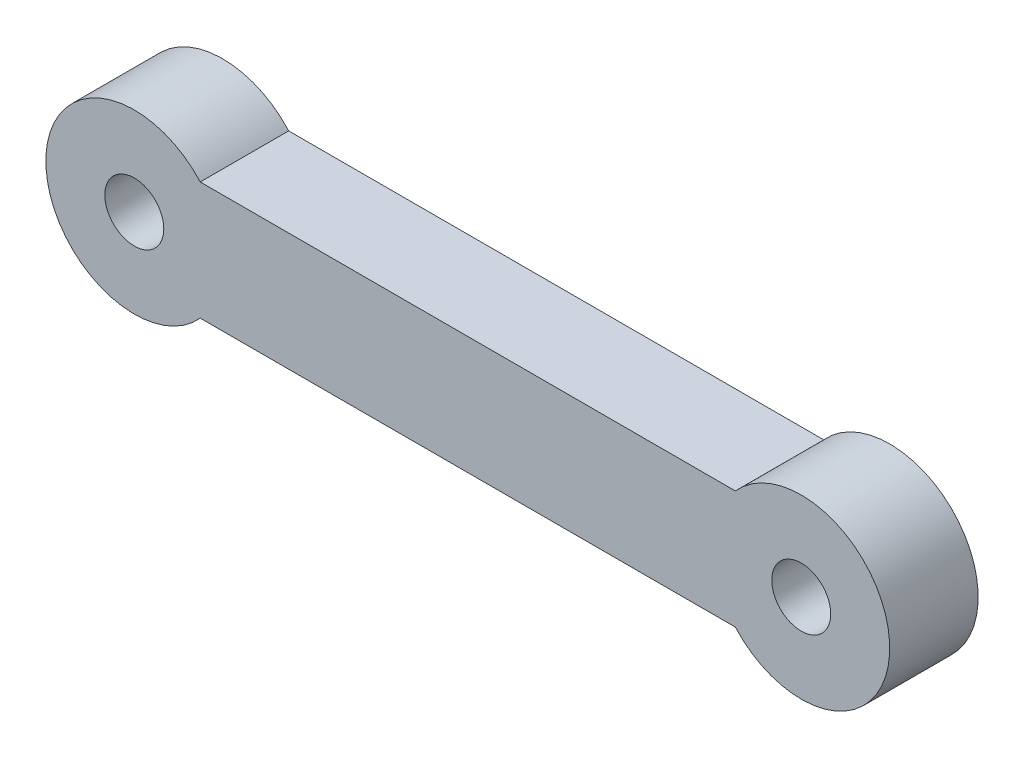
ISO-10303-21;
HEADER;
FILE_DESCRIPTION(('STEP AP214'),'2;1');
FILE_NAME('part.step','',(''),(''),'','','');
FILE_SCHEMA(('AUTOMOTIVE_DESIGN { 1 0 10303 214 1 1 1 1 }'));
ENDSEC;
DATA;
#1=APPLICATION_CONTEXT('core data for automotive mechanical design processes');
#2=APPLICATION_PROTOCOL_DEFINITION('international standard','automotive_design',2000,#1);
#3=PRODUCT_CONTEXT('',#1,'mechanical');
#4=PRODUCT('Part','Part','',(#3));
#5=PRODUCT_RELATED_PRODUCT_CATEGORY('part','',(#4));
#6=PRODUCT_DEFINITION_FORMATION('','',#4);
#7=PRODUCT_DEFINITION_CONTEXT('part definition',#1,'design');
#8=PRODUCT_DEFINITION('design','',#6,#7);
#9=PRODUCT_DEFINITION_SHAPE('','',#8);
#10=(LENGTH_UNIT() NAMED_UNIT(*) SI_UNIT(.MILLI.,.METRE.));
#11=(NAMED_UNIT(*) PLANE_ANGLE_UNIT() SI_UNIT($,.RADIAN.));
#12=(NAMED_UNIT(*) SI_UNIT($,.STERADIAN.) SOLID_ANGLE_UNIT());
#13=UNCERTAINTY_MEASURE_WITH_UNIT(LENGTH_MEASURE(1.E-05),#10,'distance_accuracy_value','');
#14=(GEOMETRIC_REPRESENTATION_CONTEXT(3) GLOBAL_UNCERTAINTY_ASSIGNED_CONTEXT((#13)) GLOBAL_UNIT_ASSIGNED_CONTEXT((#10,
#11,#12)) REPRESENTATION_CONTEXT('',''));
#15=CARTESIAN_POINT('',(0.,0.,0.));
#16=DIRECTION('',(0.,0.,1.));
#17=DIRECTION('',(1.,0.,0.));
#18=AXIS2_PLACEMENT_3D('',#15,#16,#17);
#19=CARTESIAN_POINT('',(-9.9098901723738,-1.89746503692407,3.));
#20=DIRECTION('',(0.,0.,1.));
#21=DIRECTION('',(1.,0.,0.));
#22=AXIS2_PLACEMENT_3D('',#19,#20,#21);
#23=PLANE('',#22);
#24=CARTESIAN_POINT('',(-9.9098901723738,-1.89746503692407,3.));
#25=DIRECTION('',(0.,0.,1.));
#26=DIRECTION('',(1.,0.,0.));
#27=AXIS2_PLACEMENT_3D('',#24,#25,#26);
#28=CIRCLE('',#27,1.);
#29=CARTESIAN_POINT('',(-8.9098901723738,-1.89746503692407,3.));
#30=VERTEX_POINT('',#29);
#31=EDGE_CURVE('E103',#30,#30,#28,.T.);
#32=ORIENTED_EDGE('',*,*,#31,.F.);
#33=EDGE_LOOP('',(#32));
#34=FACE_BOUND('',#33,.T.);
#35=CARTESIAN_POINT('',(-9.9098901723738,-1.89746503692407,3.));
#36=DIRECTION('',(0.,0.,1.));
#37=DIRECTION('',(1.,0.,0.));
#38=AXIS2_PLACEMENT_3D('',#35,#36,#37);
#39=CIRCLE('',#38,3.);
#40=CARTESIAN_POINT('',(-7.67382219487401,0.10253496307593,3.));
#41=VERTEX_POINT('',#40);
#42=CARTESIAN_POINT('',(-7.67382219487401,-3.89746503692407,3.));
#43=VERTEX_POINT('',#42);
#44=EDGE_CURVE('E88',#41,#43,#39,.T.);
#45=ORIENTED_EDGE('',*,*,#44,.T.);
#46=DIRECTION('',(1.,0.,0.));
#47=VECTOR('',#46,1.);
#48=CARTESIAN_POINT('',(-7.67382219487401,-3.89746503692407,3.));
#49=LINE('',#48,#47);
#50=CARTESIAN_POINT('',(10.4740418501264,-3.89746503692407,3.));
#51=VERTEX_POINT('',#50);
#52=EDGE_CURVE('E83',#43,#51,#49,.T.);
#53=ORIENTED_EDGE('',*,*,#52,.T.);
#54=CARTESIAN_POINT('',(12.7101098276262,-1.89746503692407,3.));
#55=DIRECTION('',(0.,0.,1.));
#56=DIRECTION('',(-1.,0.,0.));
#57=AXIS2_PLACEMENT_3D('',#54,#55,#56);
#58=CIRCLE('',#57,3.);
#59=CARTESIAN_POINT('',(10.4740418501264,0.10253496307593,3.));
#60=VERTEX_POINT('',#59);
#61=EDGE_CURVE('E86',#51,#60,#58,.T.);
#62=ORIENTED_EDGE('',*,*,#61,.T.);
#63=DIRECTION('',(-1.,0.,0.));
#64=VECTOR('',#63,1.);
#65=CARTESIAN_POINT('',(-7.67382219487401,0.10253496307593,3.));
#66=LINE('',#65,#64);
#67=EDGE_CURVE('E53',#60,#41,#66,.T.);
#68=ORIENTED_EDGE('',*,*,#67,.T.);
#69=EDGE_LOOP('',(#45,#53,#62,#68));
#70=FACE_BOUND('',#69,.T.);
#71=CARTESIAN_POINT('',(12.7101098276262,-1.89746503692407,3.));
#72=DIRECTION('',(0.,0.,1.));
#73=DIRECTION('',(1.,0.,0.));
#74=AXIS2_PLACEMENT_3D('',#71,#72,#73);
#75=CIRCLE('',#74,1.);
#76=CARTESIAN_POINT('',(13.7101098276262,-1.89746503692407,3.));
#77=VERTEX_POINT('',#76);
#78=EDGE_CURVE('E118',#77,#77,#75,.T.);
#79=ORIENTED_EDGE('',*,*,#78,.F.);
#80=EDGE_LOOP('',(#79));
#81=FACE_BOUND('',#80,.T.);
#82=ADVANCED_FACE('F36',(#34,#70,#81),#23,.T.);
#83=CARTESIAN_POINT('',(-9.9098901723738,-1.89746503692407,0.));
#84=DIRECTION('',(0.,0.,1.));
#85=DIRECTION('',(1.,0.,0.));
#86=AXIS2_PLACEMENT_3D('',#83,#84,#85);
#87=PLANE('',#86);
#88=CARTESIAN_POINT('',(-9.9098901723738,-1.89746503692407,0.));
#89=DIRECTION('',(0.,0.,1.));
#90=DIRECTION('',(1.,0.,0.));
#91=AXIS2_PLACEMENT_3D('',#88,#89,#90);
#92=CIRCLE('',#91,3.);
#93=CARTESIAN_POINT('',(-7.67382219487401,0.10253496307593,0.));
#94=VERTEX_POINT('',#93);
#95=CARTESIAN_POINT('',(-7.67382219487401,-3.89746503692407,0.));
#96=VERTEX_POINT('',#95);
#97=EDGE_CURVE('E100',#94,#96,#92,.T.);
#98=ORIENTED_EDGE('',*,*,#97,.F.);
#99=DIRECTION('',(-1.,0.,0.));
#100=VECTOR('',#99,1.);
#101=CARTESIAN_POINT('',(-7.67382219487401,0.10253496307593,0.));
#102=LINE('',#101,#100);
#103=CARTESIAN_POINT('',(10.4740418501264,0.10253496307593,0.));
#104=VERTEX_POINT('',#103);
#105=EDGE_CURVE('E76',#104,#94,#102,.T.);
#106=ORIENTED_EDGE('',*,*,#105,.F.);
#107=CARTESIAN_POINT('',(12.7101098276262,-1.89746503692407,0.));
#108=DIRECTION('',(0.,0.,1.));
#109=DIRECTION('',(-1.,0.,0.));
#110=AXIS2_PLACEMENT_3D('',#107,#108,#109);
#111=CIRCLE('',#110,3.);
#112=CARTESIAN_POINT('',(10.4740418501264,-3.89746503692407,0.));
#113=VERTEX_POINT('',#112);
#114=EDGE_CURVE('E70',#113,#104,#111,.T.);
#115=ORIENTED_EDGE('',*,*,#114,.F.);
#116=DIRECTION('',(1.,0.,0.));
#117=VECTOR('',#116,1.);
#118=CARTESIAN_POINT('',(-7.67382219487401,-3.89746503692407,0.));
#119=LINE('',#118,#117);
#120=EDGE_CURVE('E92',#96,#113,#119,.T.);
#121=ORIENTED_EDGE('',*,*,#120,.F.);
#122=EDGE_LOOP('',(#98,#106,#115,#121));
#123=FACE_BOUND('',#122,.T.);
#124=CARTESIAN_POINT('',(-9.9098901723738,-1.89746503692407,0.));
#125=DIRECTION('',(0.,0.,1.));
#126=DIRECTION('',(1.,0.,0.));
#127=AXIS2_PLACEMENT_3D('',#124,#125,#126);
#128=CIRCLE('',#127,1.);
#129=CARTESIAN_POINT('',(-8.9098901723738,-1.89746503692407,0.));
#130=VERTEX_POINT('',#129);
#131=EDGE_CURVE('E115',#130,#130,#128,.T.);
#132=ORIENTED_EDGE('',*,*,#131,.T.);
#133=EDGE_LOOP('',(#132));
#134=FACE_BOUND('',#133,.T.);
#135=CARTESIAN_POINT('',(12.7101098276262,-1.89746503692407,0.));
#136=DIRECTION('',(0.,0.,1.));
#137=DIRECTION('',(1.,0.,0.));
#138=AXIS2_PLACEMENT_3D('',#135,#136,#137);
#139=CIRCLE('',#138,1.);
#140=CARTESIAN_POINT('',(13.7101098276262,-1.89746503692407,0.));
#141=VERTEX_POINT('',#140);
#142=EDGE_CURVE('E121',#141,#141,#139,.T.);
#143=ORIENTED_EDGE('',*,*,#142,.T.);
#144=EDGE_LOOP('',(#143));
#145=FACE_BOUND('',#144,.T.);
#146=ADVANCED_FACE('F111',(#123,#134,#145),#87,.F.);
#147=CARTESIAN_POINT('',(-9.9098901723738,-1.89746503692407,3.));
#148=DIRECTION('',(0.,0.,-1.));
#149=DIRECTION('',(-1.,0.,0.));
#150=AXIS2_PLACEMENT_3D('',#147,#148,#149);
#151=CYLINDRICAL_SURFACE('',#150,3.);
#152=ORIENTED_EDGE('',*,*,#97,.T.);
#153=DIRECTION('',(0.,0.,-1.));
#154=VECTOR('',#153,1.);
#155=CARTESIAN_POINT('',(-7.67382219487401,-3.89746503692407,3.));
#156=LINE('',#155,#154);
#157=EDGE_CURVE('E11',#43,#96,#156,.T.);
#158=ORIENTED_EDGE('',*,*,#157,.F.);
#159=ORIENTED_EDGE('',*,*,#44,.F.);
#160=DIRECTION('',(0.,0.,-1.));
#161=VECTOR('',#160,1.);
#162=CARTESIAN_POINT('',(-7.67382219487401,0.10253496307593,3.));
#163=LINE('',#162,#161);
#164=EDGE_CURVE('E96',#41,#94,#163,.T.);
#165=ORIENTED_EDGE('',*,*,#164,.T.);
#166=EDGE_LOOP('',(#152,#158,#159,#165));
#167=FACE_BOUND('',#166,.T.);
#168=ADVANCED_FACE('F38',(#167),#151,.T.);
#169=CARTESIAN_POINT('',(-7.67382219487401,-3.89746503692407,3.));
#170=DIRECTION('',(0.,1.,0.));
#171=DIRECTION('',(0.,0.,1.));
#172=AXIS2_PLACEMENT_3D('',#169,#170,#171);
#173=PLANE('',#172);
#174=ORIENTED_EDGE('',*,*,#120,.T.);
#175=DIRECTION('',(0.,0.,-1.));
#176=VECTOR('',#175,1.);
#177=CARTESIAN_POINT('',(10.4740418501264,-3.89746503692407,3.));
#178=LINE('',#177,#176);
#179=EDGE_CURVE('E45',#51,#113,#178,.T.);
#180=ORIENTED_EDGE('',*,*,#179,.F.);
#181=ORIENTED_EDGE('',*,*,#52,.F.);
#182=ORIENTED_EDGE('',*,*,#157,.T.);
#183=EDGE_LOOP('',(#174,#180,#181,#182));
#184=FACE_BOUND('',#183,.T.);
#185=ADVANCED_FACE('F91',(#184),#173,.F.);
#186=CARTESIAN_POINT('',(12.7101098276262,-1.89746503692407,3.));
#187=DIRECTION('',(0.,0.,-1.));
#188=DIRECTION('',(-1.,0.,0.));
#189=AXIS2_PLACEMENT_3D('',#186,#187,#188);
#190=CYLINDRICAL_SURFACE('',#189,3.);
#191=ORIENTED_EDGE('',*,*,#114,.T.);
#192=DIRECTION('',(0.,0.,-1.));
#193=VECTOR('',#192,1.);
#194=CARTESIAN_POINT('',(10.4740418501264,0.10253496307593,3.));
#195=LINE('',#194,#193);
#196=EDGE_CURVE('E93',#60,#104,#195,.T.);
#197=ORIENTED_EDGE('',*,*,#196,.F.);
#198=ORIENTED_EDGE('',*,*,#61,.F.);
#199=ORIENTED_EDGE('',*,*,#179,.T.);
#200=EDGE_LOOP('',(#191,#197,#198,#199));
#201=FACE_BOUND('',#200,.T.);
#202=ADVANCED_FACE('F94',(#201),#190,.T.);
#203=CARTESIAN_POINT('',(-7.67382219487401,0.10253496307593,3.));
#204=DIRECTION('',(0.,-1.,0.));
#205=DIRECTION('',(0.,0.,-1.));
#206=AXIS2_PLACEMENT_3D('',#203,#204,#205);
#207=PLANE('',#206);
#208=ORIENTED_EDGE('',*,*,#105,.T.);
#209=ORIENTED_EDGE('',*,*,#164,.F.);
#210=ORIENTED_EDGE('',*,*,#67,.F.);
#211=ORIENTED_EDGE('',*,*,#196,.T.);
#212=EDGE_LOOP('',(#208,#209,#210,#211));
#213=FACE_BOUND('',#212,.T.);
#214=ADVANCED_FACE('F108',(#213),#207,.F.);
#215=CARTESIAN_POINT('',(-9.9098901723738,-1.89746503692407,3.));
#216=DIRECTION('',(0.,0.,-1.));
#217=DIRECTION('',(-1.,0.,0.));
#218=AXIS2_PLACEMENT_3D('',#215,#216,#217);
#219=CYLINDRICAL_SURFACE('',#218,1.);
#220=ORIENTED_EDGE('',*,*,#31,.T.);
#221=EDGE_LOOP('',(#220));
#222=FACE_BOUND('',#221,.T.);
#223=ORIENTED_EDGE('',*,*,#131,.F.);
#224=EDGE_LOOP('',(#223));
#225=FACE_BOUND('',#224,.T.);
#226=ADVANCED_FACE('F138',(#222,#225),#219,.F.);
#227=CARTESIAN_POINT('',(12.7101098276262,-1.89746503692407,3.));
#228=DIRECTION('',(0.,0.,-1.));
#229=DIRECTION('',(-1.,0.,0.));
#230=AXIS2_PLACEMENT_3D('',#227,#228,#229);
#231=CYLINDRICAL_SURFACE('',#230,1.);
#232=ORIENTED_EDGE('',*,*,#78,.T.);
#233=EDGE_LOOP('',(#232));
#234=FACE_BOUND('',#233,.T.);
#235=ORIENTED_EDGE('',*,*,#142,.F.);
#236=EDGE_LOOP('',(#235));
#237=FACE_BOUND('',#236,.T.);
#238=ADVANCED_FACE('F127',(#234,#237),#231,.F.);
#239=CLOSED_SHELL('',(#82,#146,#168,#185,#202,#214,#226,#238));
#240=MANIFOLD_SOLID_BREP('B2',#239);
#241=ADVANCED_BREP_SHAPE_REPRESENTATION('',(#18,#240),#14);
#242=SHAPE_DEFINITION_REPRESENTATION(#9,#241);
ENDSEC;
END-ISO-10303-21;
